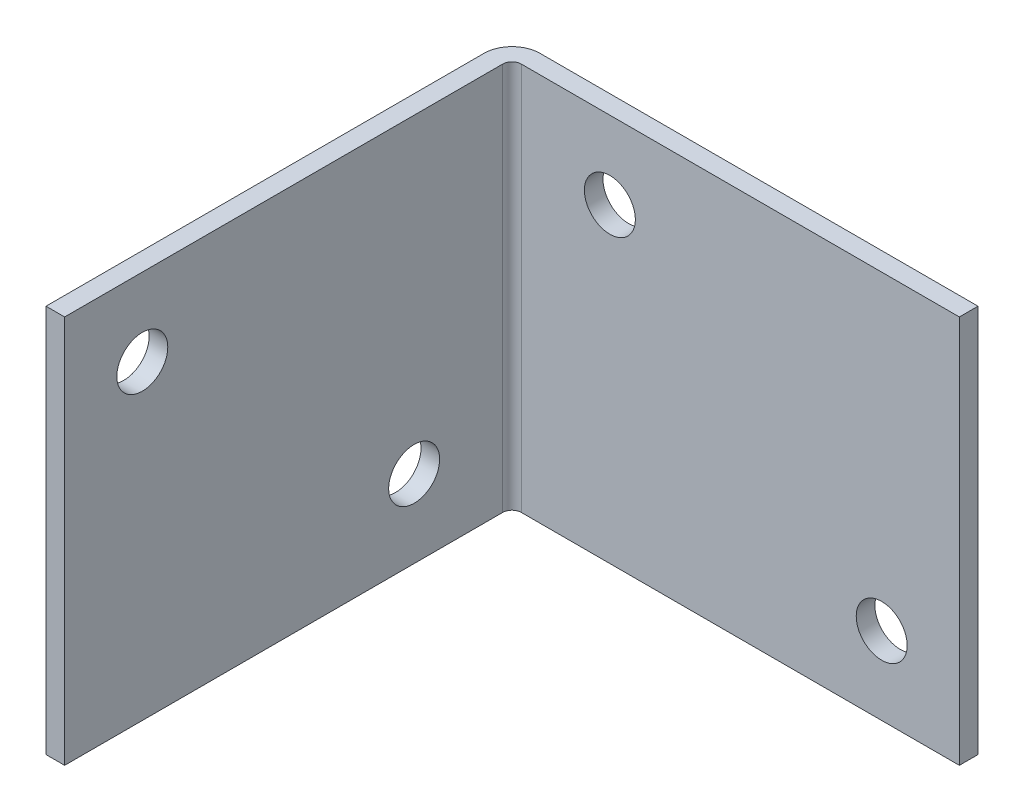
ISO-10303-21;
HEADER;
FILE_DESCRIPTION(('STEP AP214'),'2;1');
FILE_NAME('part.step','',(''),(''),'','','');
FILE_SCHEMA(('AUTOMOTIVE_DESIGN { 1 0 10303 214 1 1 1 1 }'));
ENDSEC;
DATA;
#1=APPLICATION_CONTEXT('core data for automotive mechanical design processes');
#2=APPLICATION_PROTOCOL_DEFINITION('international standard','automotive_design',2000,#1);
#3=PRODUCT_CONTEXT('',#1,'mechanical');
#4=PRODUCT('Part','Part','',(#3));
#5=PRODUCT_RELATED_PRODUCT_CATEGORY('part','',(#4));
#6=PRODUCT_DEFINITION_FORMATION('','',#4);
#7=PRODUCT_DEFINITION_CONTEXT('part definition',#1,'design');
#8=PRODUCT_DEFINITION('design','',#6,#7);
#9=PRODUCT_DEFINITION_SHAPE('','',#8);
#10=(LENGTH_UNIT() NAMED_UNIT(*) SI_UNIT(.MILLI.,.METRE.));
#11=(NAMED_UNIT(*) PLANE_ANGLE_UNIT() SI_UNIT($,.RADIAN.));
#12=(NAMED_UNIT(*) SI_UNIT($,.STERADIAN.) SOLID_ANGLE_UNIT());
#13=UNCERTAINTY_MEASURE_WITH_UNIT(LENGTH_MEASURE(1.E-05),#10,'distance_accuracy_value','');
#14=(GEOMETRIC_REPRESENTATION_CONTEXT(3) GLOBAL_UNCERTAINTY_ASSIGNED_CONTEXT((#13)) GLOBAL_UNIT_ASSIGNED_CONTEXT((#10,
#11,#12)) REPRESENTATION_CONTEXT('',''));
#15=CARTESIAN_POINT('',(0.,0.,0.));
#16=DIRECTION('',(0.,0.,1.));
#17=DIRECTION('',(1.,0.,0.));
#18=AXIS2_PLACEMENT_3D('',#15,#16,#17);
#19=CARTESIAN_POINT('',(2.286,15.875,1.524));
#20=DIRECTION('',(0.,0.,-1.));
#21=DIRECTION('',(-1.,0.,0.));
#22=AXIS2_PLACEMENT_3D('',#19,#20,#21);
#23=PLANE('',#22);
#24=CARTESIAN_POINT('',(31.75,-9.525,1.52400000000011));
#25=DIRECTION('',(0.,0.,1.));
#26=DIRECTION('',(-1.,0.,0.));
#27=AXIS2_PLACEMENT_3D('',#24,#25,#26);
#28=CIRCLE('',#27,2.0828);
#29=CARTESIAN_POINT('',(29.6672,-9.525,1.5240000000001));
#30=VERTEX_POINT('',#29);
#31=EDGE_CURVE('E197',#30,#30,#28,.T.);
#32=ORIENTED_EDGE('',*,*,#31,.F.);
#33=EDGE_LOOP('',(#32));
#34=FACE_BOUND('',#33,.T.);
#35=CARTESIAN_POINT('',(9.525,9.525,1.52400000000003));
#36=DIRECTION('',(0.,0.,1.));
#37=DIRECTION('',(-1.,0.,0.));
#38=AXIS2_PLACEMENT_3D('',#35,#36,#37);
#39=CIRCLE('',#38,2.0828);
#40=CARTESIAN_POINT('',(7.4422,9.525,1.52400000000003));
#41=VERTEX_POINT('',#40);
#42=EDGE_CURVE('E191',#41,#41,#39,.T.);
#43=ORIENTED_EDGE('',*,*,#42,.F.);
#44=EDGE_LOOP('',(#43));
#45=FACE_BOUND('',#44,.T.);
#46=DIRECTION('',(1.,0.,0.));
#47=VECTOR('',#46,1.);
#48=CARTESIAN_POINT('',(2.286,-15.875,1.524));
#49=LINE('',#48,#47);
#50=CARTESIAN_POINT('',(2.286,-15.875,1.524));
#51=VERTEX_POINT('',#50);
#52=CARTESIAN_POINT('',(38.1,-15.875,1.524));
#53=VERTEX_POINT('',#52);
#54=EDGE_CURVE('E131',#51,#53,#49,.T.);
#55=ORIENTED_EDGE('',*,*,#54,.T.);
#56=DIRECTION('',(0.,-1.,0.));
#57=VECTOR('',#56,1.);
#58=CARTESIAN_POINT('',(38.1,15.875,1.524));
#59=LINE('',#58,#57);
#60=CARTESIAN_POINT('',(38.1,15.875,1.524));
#61=VERTEX_POINT('',#60);
#62=EDGE_CURVE('E11',#61,#53,#59,.T.);
#63=ORIENTED_EDGE('',*,*,#62,.F.);
#64=DIRECTION('',(1.,0.,0.));
#65=VECTOR('',#64,1.);
#66=CARTESIAN_POINT('',(2.286,15.875,1.524));
#67=LINE('',#66,#65);
#68=CARTESIAN_POINT('',(2.286,15.875,1.524));
#69=VERTEX_POINT('',#68);
#70=EDGE_CURVE('E89',#69,#61,#67,.T.);
#71=ORIENTED_EDGE('',*,*,#70,.F.);
#72=DIRECTION('',(0.,-1.,0.));
#73=VECTOR('',#72,1.);
#74=CARTESIAN_POINT('',(2.286,15.875,1.524));
#75=LINE('',#74,#73);
#76=EDGE_CURVE('E130',#69,#51,#75,.T.);
#77=ORIENTED_EDGE('',*,*,#76,.T.);
#78=EDGE_LOOP('',(#55,#63,#71,#77));
#79=FACE_BOUND('',#78,.T.);
#80=ADVANCED_FACE('F34',(#34,#45,#79),#23,.F.);
#81=CARTESIAN_POINT('',(38.1,15.875,0.));
#82=DIRECTION('',(1.,0.,0.));
#83=DIRECTION('',(0.,0.,-1.));
#84=AXIS2_PLACEMENT_3D('',#81,#82,#83);
#85=PLANE('',#84);
#86=DIRECTION('',(0.,0.,1.));
#87=VECTOR('',#86,1.);
#88=CARTESIAN_POINT('',(38.1,-15.875,0.));
#89=LINE('',#88,#87);
#90=CARTESIAN_POINT('',(38.1,-15.875,0.));
#91=VERTEX_POINT('',#90);
#92=EDGE_CURVE('E134',#91,#53,#89,.T.);
#93=ORIENTED_EDGE('',*,*,#92,.F.);
#94=DIRECTION('',(0.,-1.,0.));
#95=VECTOR('',#94,1.);
#96=CARTESIAN_POINT('',(38.1,15.875,0.));
#97=LINE('',#96,#95);
#98=CARTESIAN_POINT('',(38.1,15.875,0.));
#99=VERTEX_POINT('',#98);
#100=EDGE_CURVE('E42',#99,#91,#97,.T.);
#101=ORIENTED_EDGE('',*,*,#100,.F.);
#102=DIRECTION('',(0.,0.,1.));
#103=VECTOR('',#102,1.);
#104=CARTESIAN_POINT('',(38.1,15.875,0.));
#105=LINE('',#104,#103);
#106=EDGE_CURVE('E174',#99,#61,#105,.T.);
#107=ORIENTED_EDGE('',*,*,#106,.T.);
#108=ORIENTED_EDGE('',*,*,#62,.T.);
#109=EDGE_LOOP('',(#93,#101,#107,#108));
#110=FACE_BOUND('',#109,.T.);
#111=ADVANCED_FACE('F165',(#110),#85,.T.);
#112=CARTESIAN_POINT('',(2.286,15.875,0.));
#113=DIRECTION('',(0.,0.,-1.));
#114=DIRECTION('',(-1.,0.,0.));
#115=AXIS2_PLACEMENT_3D('',#112,#113,#114);
#116=PLANE('',#115);
#117=CARTESIAN_POINT('',(31.75,-9.525,0.));
#118=DIRECTION('',(0.,0.,1.));
#119=DIRECTION('',(-1.,0.,0.));
#120=AXIS2_PLACEMENT_3D('',#117,#118,#119);
#121=CIRCLE('',#120,2.0828);
#122=CARTESIAN_POINT('',(29.6672,-9.525,0.));
#123=VERTEX_POINT('',#122);
#124=EDGE_CURVE('E194',#123,#123,#121,.T.);
#125=ORIENTED_EDGE('',*,*,#124,.T.);
#126=EDGE_LOOP('',(#125));
#127=FACE_BOUND('',#126,.T.);
#128=CARTESIAN_POINT('',(9.525,9.525,0.));
#129=DIRECTION('',(0.,0.,1.));
#130=DIRECTION('',(-1.,0.,0.));
#131=AXIS2_PLACEMENT_3D('',#128,#129,#130);
#132=CIRCLE('',#131,2.0828);
#133=CARTESIAN_POINT('',(7.4422,9.525,-1.05067093290735E-13));
#134=VERTEX_POINT('',#133);
#135=EDGE_CURVE('E188',#134,#134,#132,.T.);
#136=ORIENTED_EDGE('',*,*,#135,.T.);
#137=EDGE_LOOP('',(#136));
#138=FACE_BOUND('',#137,.T.);
#139=DIRECTION('',(1.,0.,0.));
#140=VECTOR('',#139,1.);
#141=CARTESIAN_POINT('',(2.286,-15.875,0.));
#142=LINE('',#141,#140);
#143=CARTESIAN_POINT('',(2.286,-15.875,0.));
#144=VERTEX_POINT('',#143);
#145=EDGE_CURVE('E138',#144,#91,#142,.T.);
#146=ORIENTED_EDGE('',*,*,#145,.F.);
#147=DIRECTION('',(0.,-1.,0.));
#148=VECTOR('',#147,1.);
#149=CARTESIAN_POINT('',(2.286,15.875,0.));
#150=LINE('',#149,#148);
#151=CARTESIAN_POINT('',(2.286,15.875,0.));
#152=VERTEX_POINT('',#151);
#153=EDGE_CURVE('E155',#152,#144,#150,.T.);
#154=ORIENTED_EDGE('',*,*,#153,.F.);
#155=DIRECTION('',(1.,0.,0.));
#156=VECTOR('',#155,1.);
#157=CARTESIAN_POINT('',(2.286,15.875,0.));
#158=LINE('',#157,#156);
#159=EDGE_CURVE('E162',#152,#99,#158,.T.);
#160=ORIENTED_EDGE('',*,*,#159,.T.);
#161=ORIENTED_EDGE('',*,*,#100,.T.);
#162=EDGE_LOOP('',(#146,#154,#160,#161));
#163=FACE_BOUND('',#162,.T.);
#164=ADVANCED_FACE('F160',(#127,#138,#163),#116,.T.);
#165=CARTESIAN_POINT('',(2.286,15.875,2.286));
#166=DIRECTION('',(0.,-1.,0.));
#167=DIRECTION('',(0.,0.,-1.));
#168=AXIS2_PLACEMENT_3D('',#165,#166,#167);
#169=CYLINDRICAL_SURFACE('',#168,2.286);
#170=CARTESIAN_POINT('',(2.286,-15.875,2.286));
#171=DIRECTION('',(0.,-1.,0.));
#172=DIRECTION('',(0.,0.,1.));
#173=AXIS2_PLACEMENT_3D('',#170,#171,#172);
#174=CIRCLE('',#173,2.286);
#175=CARTESIAN_POINT('',(0.,-15.875,2.286));
#176=VERTEX_POINT('',#175);
#177=EDGE_CURVE('E141',#176,#144,#174,.T.);
#178=ORIENTED_EDGE('',*,*,#177,.F.);
#179=DIRECTION('',(0.,-1.,0.));
#180=VECTOR('',#179,1.);
#181=CARTESIAN_POINT('',(0.,15.875,2.286));
#182=LINE('',#181,#180);
#183=CARTESIAN_POINT('',(0.,15.875,2.286));
#184=VERTEX_POINT('',#183);
#185=EDGE_CURVE('E153',#184,#176,#182,.T.);
#186=ORIENTED_EDGE('',*,*,#185,.F.);
#187=CARTESIAN_POINT('',(2.286,15.875,2.286));
#188=DIRECTION('',(0.,-1.,0.));
#189=DIRECTION('',(0.,0.,1.));
#190=AXIS2_PLACEMENT_3D('',#187,#188,#189);
#191=CIRCLE('',#190,2.286);
#192=EDGE_CURVE('E125',#184,#152,#191,.T.);
#193=ORIENTED_EDGE('',*,*,#192,.T.);
#194=ORIENTED_EDGE('',*,*,#153,.T.);
#195=EDGE_LOOP('',(#178,#186,#193,#194));
#196=FACE_BOUND('',#195,.T.);
#197=ADVANCED_FACE('F172',(#196),#169,.T.);
#198=CARTESIAN_POINT('',(0.,15.875,38.1));
#199=DIRECTION('',(-1.,0.,0.));
#200=DIRECTION('',(0.,0.,1.));
#201=AXIS2_PLACEMENT_3D('',#198,#199,#200);
#202=PLANE('',#201);
#203=CARTESIAN_POINT('',(0.,9.525,31.75));
#204=DIRECTION('',(1.,0.,0.));
#205=DIRECTION('',(0.,0.,-1.));
#206=AXIS2_PLACEMENT_3D('',#203,#204,#205);
#207=CIRCLE('',#206,2.0828);
#208=CARTESIAN_POINT('',(0.,9.525,29.6672));
#209=VERTEX_POINT('',#208);
#210=EDGE_CURVE('E182',#209,#209,#207,.T.);
#211=ORIENTED_EDGE('',*,*,#210,.T.);
#212=EDGE_LOOP('',(#211));
#213=FACE_BOUND('',#212,.T.);
#214=CARTESIAN_POINT('',(0.,-9.525,9.525));
#215=DIRECTION('',(1.,0.,0.));
#216=DIRECTION('',(0.,0.,-1.));
#217=AXIS2_PLACEMENT_3D('',#214,#215,#216);
#218=CIRCLE('',#217,2.0828);
#219=CARTESIAN_POINT('',(0.,-9.525,7.4422));
#220=VERTEX_POINT('',#219);
#221=EDGE_CURVE('E135',#220,#220,#218,.T.);
#222=ORIENTED_EDGE('',*,*,#221,.T.);
#223=EDGE_LOOP('',(#222));
#224=FACE_BOUND('',#223,.T.);
#225=DIRECTION('',(0.,0.,-1.));
#226=VECTOR('',#225,1.);
#227=CARTESIAN_POINT('',(0.,-15.875,38.1));
#228=LINE('',#227,#226);
#229=CARTESIAN_POINT('',(0.,-15.875,38.1));
#230=VERTEX_POINT('',#229);
#231=EDGE_CURVE('E144',#230,#176,#228,.T.);
#232=ORIENTED_EDGE('',*,*,#231,.F.);
#233=DIRECTION('',(0.,-1.,0.));
#234=VECTOR('',#233,1.);
#235=CARTESIAN_POINT('',(0.,15.875,38.1));
#236=LINE('',#235,#234);
#237=CARTESIAN_POINT('',(0.,15.875,38.1));
#238=VERTEX_POINT('',#237);
#239=EDGE_CURVE('E113',#238,#230,#236,.T.);
#240=ORIENTED_EDGE('',*,*,#239,.F.);
#241=DIRECTION('',(0.,0.,-1.));
#242=VECTOR('',#241,1.);
#243=CARTESIAN_POINT('',(0.,15.875,38.1));
#244=LINE('',#243,#242);
#245=EDGE_CURVE('E123',#238,#184,#244,.T.);
#246=ORIENTED_EDGE('',*,*,#245,.T.);
#247=ORIENTED_EDGE('',*,*,#185,.T.);
#248=EDGE_LOOP('',(#232,#240,#246,#247));
#249=FACE_BOUND('',#248,.T.);
#250=ADVANCED_FACE('F230',(#213,#224,#249),#202,.T.);
#251=CARTESIAN_POINT('',(1.524,15.875,38.1));
#252=DIRECTION('',(0.,0.,1.));
#253=DIRECTION('',(1.,0.,0.));
#254=AXIS2_PLACEMENT_3D('',#251,#252,#253);
#255=PLANE('',#254);
#256=DIRECTION('',(-1.,0.,0.));
#257=VECTOR('',#256,1.);
#258=CARTESIAN_POINT('',(1.524,-15.875,38.1));
#259=LINE('',#258,#257);
#260=CARTESIAN_POINT('',(1.524,-15.875,38.1));
#261=VERTEX_POINT('',#260);
#262=EDGE_CURVE('E112',#261,#230,#259,.T.);
#263=ORIENTED_EDGE('',*,*,#262,.F.);
#264=DIRECTION('',(0.,-1.,0.));
#265=VECTOR('',#264,1.);
#266=CARTESIAN_POINT('',(1.524,15.875,38.1));
#267=LINE('',#266,#265);
#268=CARTESIAN_POINT('',(1.524,15.875,38.1));
#269=VERTEX_POINT('',#268);
#270=EDGE_CURVE('E106',#269,#261,#267,.T.);
#271=ORIENTED_EDGE('',*,*,#270,.F.);
#272=DIRECTION('',(-1.,0.,0.));
#273=VECTOR('',#272,1.);
#274=CARTESIAN_POINT('',(1.524,15.875,38.1));
#275=LINE('',#274,#273);
#276=EDGE_CURVE('E110',#269,#238,#275,.T.);
#277=ORIENTED_EDGE('',*,*,#276,.T.);
#278=ORIENTED_EDGE('',*,*,#239,.T.);
#279=EDGE_LOOP('',(#263,#271,#277,#278));
#280=FACE_BOUND('',#279,.T.);
#281=ADVANCED_FACE('F108',(#280),#255,.T.);
#282=CARTESIAN_POINT('',(1.524,15.875,38.1));
#283=DIRECTION('',(-1.,0.,0.));
#284=DIRECTION('',(0.,0.,1.));
#285=AXIS2_PLACEMENT_3D('',#282,#283,#284);
#286=PLANE('',#285);
#287=CARTESIAN_POINT('',(1.524,9.525,31.75));
#288=DIRECTION('',(1.,0.,0.));
#289=DIRECTION('',(0.,0.,-1.));
#290=AXIS2_PLACEMENT_3D('',#287,#288,#289);
#291=CIRCLE('',#290,2.0828);
#292=CARTESIAN_POINT('',(1.524,9.525,29.6672));
#293=VERTEX_POINT('',#292);
#294=EDGE_CURVE('E185',#293,#293,#291,.T.);
#295=ORIENTED_EDGE('',*,*,#294,.F.);
#296=EDGE_LOOP('',(#295));
#297=FACE_BOUND('',#296,.T.);
#298=CARTESIAN_POINT('',(1.524,-9.525,9.525));
#299=DIRECTION('',(1.,0.,0.));
#300=DIRECTION('',(0.,0.,-1.));
#301=AXIS2_PLACEMENT_3D('',#298,#299,#300);
#302=CIRCLE('',#301,2.0828);
#303=CARTESIAN_POINT('',(1.524,-9.525,7.4422));
#304=VERTEX_POINT('',#303);
#305=EDGE_CURVE('E179',#304,#304,#302,.T.);
#306=ORIENTED_EDGE('',*,*,#305,.F.);
#307=EDGE_LOOP('',(#306));
#308=FACE_BOUND('',#307,.T.);
#309=DIRECTION('',(0.,0.,-1.));
#310=VECTOR('',#309,1.);
#311=CARTESIAN_POINT('',(1.524,-15.875,38.1));
#312=LINE('',#311,#310);
#313=CARTESIAN_POINT('',(1.524,-15.875,2.286));
#314=VERTEX_POINT('',#313);
#315=EDGE_CURVE('E77',#261,#314,#312,.T.);
#316=ORIENTED_EDGE('',*,*,#315,.T.);
#317=DIRECTION('',(0.,-1.,0.));
#318=VECTOR('',#317,1.);
#319=CARTESIAN_POINT('',(1.524,15.875,2.286));
#320=LINE('',#319,#318);
#321=CARTESIAN_POINT('',(1.524,15.875,2.286));
#322=VERTEX_POINT('',#321);
#323=EDGE_CURVE('E114',#322,#314,#320,.T.);
#324=ORIENTED_EDGE('',*,*,#323,.F.);
#325=DIRECTION('',(0.,0.,-1.));
#326=VECTOR('',#325,1.);
#327=CARTESIAN_POINT('',(1.524,15.875,38.1));
#328=LINE('',#327,#326);
#329=EDGE_CURVE('E116',#269,#322,#328,.T.);
#330=ORIENTED_EDGE('',*,*,#329,.F.);
#331=ORIENTED_EDGE('',*,*,#270,.T.);
#332=EDGE_LOOP('',(#316,#324,#330,#331));
#333=FACE_BOUND('',#332,.T.);
#334=ADVANCED_FACE('F117',(#297,#308,#333),#286,.F.);
#335=CARTESIAN_POINT('',(2.286,15.875,2.286));
#336=DIRECTION('',(0.,-1.,0.));
#337=DIRECTION('',(0.,0.,-1.));
#338=AXIS2_PLACEMENT_3D('',#335,#336,#337);
#339=CYLINDRICAL_SURFACE('',#338,0.762);
#340=CARTESIAN_POINT('',(2.286,-15.875,2.286));
#341=DIRECTION('',(0.,1.,0.));
#342=DIRECTION('',(1.,0.,0.));
#343=AXIS2_PLACEMENT_3D('',#340,#341,#342);
#344=CIRCLE('',#343,0.762);
#345=EDGE_CURVE('E83',#314,#51,#344,.F.);
#346=ORIENTED_EDGE('',*,*,#345,.T.);
#347=ORIENTED_EDGE('',*,*,#76,.F.);
#348=CARTESIAN_POINT('',(2.286,15.875,2.286));
#349=DIRECTION('',(0.,1.,0.));
#350=DIRECTION('',(1.,0.,0.));
#351=AXIS2_PLACEMENT_3D('',#348,#349,#350);
#352=CIRCLE('',#351,0.762);
#353=EDGE_CURVE('E50',#322,#69,#352,.F.);
#354=ORIENTED_EDGE('',*,*,#353,.F.);
#355=ORIENTED_EDGE('',*,*,#323,.T.);
#356=EDGE_LOOP('',(#346,#347,#354,#355));
#357=FACE_BOUND('',#356,.T.);
#358=ADVANCED_FACE('F216',(#357),#339,.F.);
#359=CARTESIAN_POINT('',(2.286,15.875,2.286));
#360=DIRECTION('',(0.,-1.,0.));
#361=DIRECTION('',(-1.,0.,0.));
#362=AXIS2_PLACEMENT_3D('',#359,#360,#361);
#363=PLANE('',#362);
#364=ORIENTED_EDGE('',*,*,#70,.T.);
#365=ORIENTED_EDGE('',*,*,#106,.F.);
#366=ORIENTED_EDGE('',*,*,#159,.F.);
#367=ORIENTED_EDGE('',*,*,#192,.F.);
#368=ORIENTED_EDGE('',*,*,#245,.F.);
#369=ORIENTED_EDGE('',*,*,#276,.F.);
#370=ORIENTED_EDGE('',*,*,#329,.T.);
#371=ORIENTED_EDGE('',*,*,#353,.T.);
#372=EDGE_LOOP('',(#364,#365,#366,#367,#368,#369,#370,#371));
#373=FACE_BOUND('',#372,.T.);
#374=ADVANCED_FACE('F120',(#373),#363,.F.);
#375=CARTESIAN_POINT('',(2.286,-15.875,2.286));
#376=DIRECTION('',(0.,-1.,0.));
#377=DIRECTION('',(-1.,0.,0.));
#378=AXIS2_PLACEMENT_3D('',#375,#376,#377);
#379=PLANE('',#378);
#380=ORIENTED_EDGE('',*,*,#54,.F.);
#381=ORIENTED_EDGE('',*,*,#345,.F.);
#382=ORIENTED_EDGE('',*,*,#315,.F.);
#383=ORIENTED_EDGE('',*,*,#262,.T.);
#384=ORIENTED_EDGE('',*,*,#231,.T.);
#385=ORIENTED_EDGE('',*,*,#177,.T.);
#386=ORIENTED_EDGE('',*,*,#145,.T.);
#387=ORIENTED_EDGE('',*,*,#92,.T.);
#388=EDGE_LOOP('',(#380,#381,#382,#383,#384,#385,#386,#387));
#389=FACE_BOUND('',#388,.T.);
#390=ADVANCED_FACE('F168',(#389),#379,.T.);
#391=CARTESIAN_POINT('',(0.,-9.525,9.525));
#392=DIRECTION('',(1.,0.,0.));
#393=DIRECTION('',(0.,0.,-1.));
#394=AXIS2_PLACEMENT_3D('',#391,#392,#393);
#395=CYLINDRICAL_SURFACE('',#394,2.0828);
#396=ORIENTED_EDGE('',*,*,#221,.F.);
#397=EDGE_LOOP('',(#396));
#398=FACE_BOUND('',#397,.T.);
#399=ORIENTED_EDGE('',*,*,#305,.T.);
#400=EDGE_LOOP('',(#399));
#401=FACE_BOUND('',#400,.T.);
#402=ADVANCED_FACE('F270',(#398,#401),#395,.F.);
#403=CARTESIAN_POINT('',(0.,9.525,31.75));
#404=DIRECTION('',(1.,0.,0.));
#405=DIRECTION('',(0.,0.,-1.));
#406=AXIS2_PLACEMENT_3D('',#403,#404,#405);
#407=CYLINDRICAL_SURFACE('',#406,2.0828);
#408=ORIENTED_EDGE('',*,*,#210,.F.);
#409=EDGE_LOOP('',(#408));
#410=FACE_BOUND('',#409,.T.);
#411=ORIENTED_EDGE('',*,*,#294,.T.);
#412=EDGE_LOOP('',(#411));
#413=FACE_BOUND('',#412,.T.);
#414=ADVANCED_FACE('F275',(#410,#413),#407,.F.);
#415=CARTESIAN_POINT('',(9.525,9.525,0.));
#416=DIRECTION('',(0.,0.,1.));
#417=DIRECTION('',(1.,0.,0.));
#418=AXIS2_PLACEMENT_3D('',#415,#416,#417);
#419=CYLINDRICAL_SURFACE('',#418,2.0828);
#420=ORIENTED_EDGE('',*,*,#135,.F.);
#421=EDGE_LOOP('',(#420));
#422=FACE_BOUND('',#421,.T.);
#423=ORIENTED_EDGE('',*,*,#42,.T.);
#424=EDGE_LOOP('',(#423));
#425=FACE_BOUND('',#424,.T.);
#426=ADVANCED_FACE('F208',(#422,#425),#419,.F.);
#427=CARTESIAN_POINT('',(31.75,-9.525,0.));
#428=DIRECTION('',(0.,0.,1.));
#429=DIRECTION('',(1.,0.,0.));
#430=AXIS2_PLACEMENT_3D('',#427,#428,#429);
#431=CYLINDRICAL_SURFACE('',#430,2.0828);
#432=ORIENTED_EDGE('',*,*,#124,.F.);
#433=EDGE_LOOP('',(#432));
#434=FACE_BOUND('',#433,.T.);
#435=ORIENTED_EDGE('',*,*,#31,.T.);
#436=EDGE_LOOP('',(#435));
#437=FACE_BOUND('',#436,.T.);
#438=ADVANCED_FACE('F205',(#434,#437),#431,.F.);
#439=CLOSED_SHELL('',(#80,#111,#164,#197,#250,#281,#334,#358,#374,#390,#402,#414,#426,#438));
#440=MANIFOLD_SOLID_BREP('B2',#439);
#441=ADVANCED_BREP_SHAPE_REPRESENTATION('',(#18,#440),#14);
#442=SHAPE_DEFINITION_REPRESENTATION(#9,#441);
ENDSEC;
END-ISO-10303-21;
